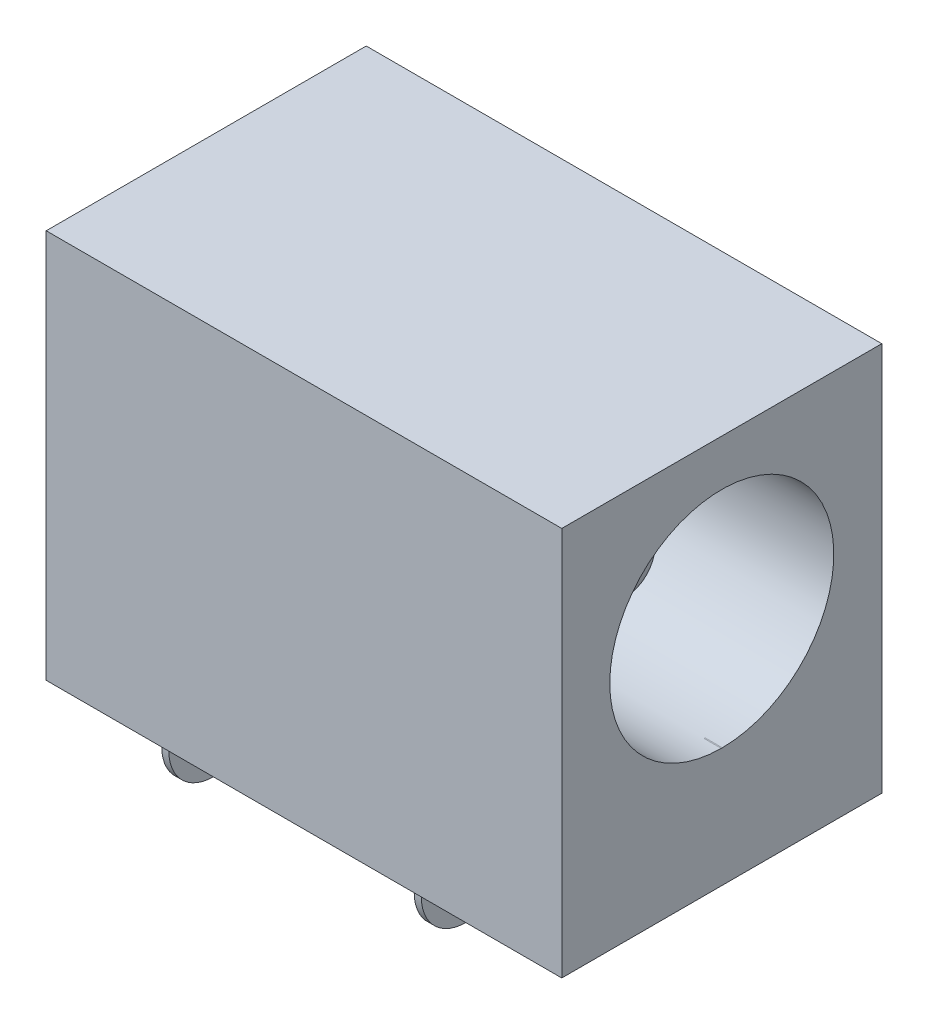
ISO-10303-21;
HEADER;
FILE_DESCRIPTION(('STEP AP214'),'2;1');
FILE_NAME('part.step','',(''),(''),'','','');
FILE_SCHEMA(('AUTOMOTIVE_DESIGN { 1 0 10303 214 1 1 1 1 }'));
ENDSEC;
DATA;
#1=APPLICATION_CONTEXT('core data for automotive mechanical design processes');
#2=APPLICATION_PROTOCOL_DEFINITION('international standard','automotive_design',2000,#1);
#3=PRODUCT_CONTEXT('',#1,'mechanical');
#4=PRODUCT('Part','Part','',(#3));
#5=PRODUCT_RELATED_PRODUCT_CATEGORY('part','',(#4));
#6=PRODUCT_DEFINITION_FORMATION('','',#4);
#7=PRODUCT_DEFINITION_CONTEXT('part definition',#1,'design');
#8=PRODUCT_DEFINITION('design','',#6,#7);
#9=PRODUCT_DEFINITION_SHAPE('','',#8);
#10=(LENGTH_UNIT() NAMED_UNIT(*) SI_UNIT(.MILLI.,.METRE.));
#11=(NAMED_UNIT(*) PLANE_ANGLE_UNIT() SI_UNIT($,.RADIAN.));
#12=(NAMED_UNIT(*) SI_UNIT($,.STERADIAN.) SOLID_ANGLE_UNIT());
#13=UNCERTAINTY_MEASURE_WITH_UNIT(LENGTH_MEASURE(1.E-05),#10,'distance_accuracy_value','');
#14=(GEOMETRIC_REPRESENTATION_CONTEXT(3) GLOBAL_UNCERTAINTY_ASSIGNED_CONTEXT((#13)) GLOBAL_UNIT_ASSIGNED_CONTEXT((#10,
#11,#12)) REPRESENTATION_CONTEXT('',''));
#15=CARTESIAN_POINT('',(0.,0.,0.));
#16=DIRECTION('',(0.,0.,1.));
#17=DIRECTION('',(1.,0.,0.));
#18=AXIS2_PLACEMENT_3D('',#15,#16,#17);
#19=CARTESIAN_POINT('',(0.,0.,4.25));
#20=DIRECTION('',(0.,-1.,0.));
#21=DIRECTION('',(0.,0.,-1.));
#22=AXIS2_PLACEMENT_3D('',#19,#20,#21);
#23=PLANE('',#22);
#24=DIRECTION('',(0.,0.,1.));
#25=VECTOR('',#24,1.);
#26=CARTESIAN_POINT('',(7.25,0.,0.));
#27=LINE('',#26,#25);
#28=CARTESIAN_POINT('',(7.25,0.,-4.5));
#29=VERTEX_POINT('',#28);
#30=CARTESIAN_POINT('',(7.25,0.,4.5));
#31=VERTEX_POINT('',#30);
#32=EDGE_CURVE('P0_E187',#29,#31,#27,.T.);
#33=ORIENTED_EDGE('',*,*,#32,.T.);
#34=DIRECTION('',(1.,0.,0.));
#35=VECTOR('',#34,1.);
#36=CARTESIAN_POINT('',(-7.25,0.,4.5));
#37=LINE('',#36,#35);
#38=CARTESIAN_POINT('',(-7.25,0.,4.5));
#39=VERTEX_POINT('',#38);
#40=EDGE_CURVE('P0_E132',#39,#31,#37,.T.);
#41=ORIENTED_EDGE('',*,*,#40,.F.);
#42=DIRECTION('',(0.,0.,1.));
#43=VECTOR('',#42,1.);
#44=CARTESIAN_POINT('',(-7.25,0.,0.));
#45=LINE('',#44,#43);
#46=CARTESIAN_POINT('',(-7.25,0.,-4.5));
#47=VERTEX_POINT('',#46);
#48=EDGE_CURVE('P0_E157',#47,#39,#45,.T.);
#49=ORIENTED_EDGE('',*,*,#48,.F.);
#50=DIRECTION('',(-1.,0.,0.));
#51=VECTOR('',#50,1.);
#52=CARTESIAN_POINT('',(-7.25,0.,-4.5));
#53=LINE('',#52,#51);
#54=EDGE_CURVE('P0_E193',#29,#47,#53,.T.);
#55=ORIENTED_EDGE('',*,*,#54,.F.);
#56=EDGE_LOOP('',(#33,#41,#49,#55));
#57=FACE_BOUND('',#56,.T.);
#58=ADVANCED_FACE('P0_F17',(#57),#23,.T.);
#59=CARTESIAN_POINT('',(0.,6.499962091467,0.));
#60=DIRECTION('',(1.,0.,0.));
#61=DIRECTION('',(0.,0.,-1.));
#62=AXIS2_PLACEMENT_3D('',#59,#60,#61);
#63=CYLINDRICAL_SURFACE('',#62,3.15);
#64=DIRECTION('',(1.,0.,0.));
#65=VECTOR('',#64,1.);
#66=CARTESIAN_POINT('',(0.,3.35,-0.01545387722779));
#67=LINE('',#66,#65);
#68=CARTESIAN_POINT('',(6.77,3.35,-0.01545387722618));
#69=VERTEX_POINT('',#68);
#70=CARTESIAN_POINT('',(7.25,3.35,-0.01545387722609));
#71=VERTEX_POINT('',#70);
#72=EDGE_CURVE('P0_E133',#69,#71,#67,.T.);
#73=ORIENTED_EDGE('',*,*,#72,.T.);
#74=CARTESIAN_POINT('',(7.25,6.499962091467,0.));
#75=DIRECTION('',(1.,0.,0.));
#76=DIRECTION('',(0.,0.,-1.));
#77=AXIS2_PLACEMENT_3D('',#74,#75,#76);
#78=CIRCLE('',#77,3.15);
#79=CARTESIAN_POINT('',(7.25,6.499962091467,3.15));
#80=VERTEX_POINT('',#79);
#81=EDGE_CURVE('P0_E146',#71,#80,#78,.T.);
#82=ORIENTED_EDGE('',*,*,#81,.T.);
#83=DIRECTION('',(-1.,0.,0.));
#84=VECTOR('',#83,1.);
#85=CARTESIAN_POINT('',(0.,6.499962091467,3.15));
#86=LINE('',#85,#84);
#87=CARTESIAN_POINT('',(-7.25,6.499962091467,3.15));
#88=VERTEX_POINT('',#87);
#89=EDGE_CURVE('P0_E11',#80,#88,#86,.T.);
#90=ORIENTED_EDGE('',*,*,#89,.T.);
#91=CARTESIAN_POINT('',(-7.25,6.499962091467,0.));
#92=DIRECTION('',(-1.,0.,0.));
#93=DIRECTION('',(0.,0.,-1.));
#94=AXIS2_PLACEMENT_3D('',#91,#92,#93);
#95=CIRCLE('',#94,3.15);
#96=CARTESIAN_POINT('',(-7.25,7.49999999999,2.987042715047));
#97=VERTEX_POINT('',#96);
#98=EDGE_CURVE('P0_E188',#88,#97,#95,.T.);
#99=ORIENTED_EDGE('',*,*,#98,.T.);
#100=DIRECTION('',(1.,0.,0.));
#101=VECTOR('',#100,1.);
#102=CARTESIAN_POINT('',(0.,7.499999999993,2.987042715046));
#103=LINE('',#102,#101);
#104=CARTESIAN_POINT('',(-3.55,7.5,2.987042715044));
#105=VERTEX_POINT('',#104);
#106=EDGE_CURVE('P0_E171',#97,#105,#103,.T.);
#107=ORIENTED_EDGE('',*,*,#106,.T.);
#108=CARTESIAN_POINT('',(-3.55,6.499962091467,0.));
#109=DIRECTION('',(-1.,0.,0.));
#110=DIRECTION('',(0.,0.,-1.));
#111=AXIS2_PLACEMENT_3D('',#108,#109,#110);
#112=CIRCLE('',#111,3.15);
#113=CARTESIAN_POINT('',(-3.55,7.5,-2.987042715044));
#114=VERTEX_POINT('',#113);
#115=EDGE_CURVE('P0_E162',#105,#114,#112,.T.);
#116=ORIENTED_EDGE('',*,*,#115,.T.);
#117=DIRECTION('',(-1.,0.,0.));
#118=VECTOR('',#117,1.);
#119=CARTESIAN_POINT('',(0.,7.499999999993,-2.987042715046));
#120=LINE('',#119,#118);
#121=CARTESIAN_POINT('',(-7.25,7.49999999999,-2.987042715047));
#122=VERTEX_POINT('',#121);
#123=EDGE_CURVE('P0_E167',#114,#122,#120,.T.);
#124=ORIENTED_EDGE('',*,*,#123,.T.);
#125=CARTESIAN_POINT('',(-7.25,6.499962091467,0.));
#126=DIRECTION('',(-1.,0.,0.));
#127=DIRECTION('',(0.,0.,-1.));
#128=AXIS2_PLACEMENT_3D('',#125,#126,#127);
#129=CIRCLE('',#128,3.15);
#130=CARTESIAN_POINT('',(-7.25,5.5,-2.987068096919));
#131=VERTEX_POINT('',#130);
#132=EDGE_CURVE('P0_E21',#122,#131,#129,.T.);
#133=ORIENTED_EDGE('',*,*,#132,.T.);
#134=DIRECTION('',(1.,0.,0.));
#135=VECTOR('',#134,1.);
#136=CARTESIAN_POINT('',(0.,5.500000000006,-2.987068096921));
#137=LINE('',#136,#135);
#138=CARTESIAN_POINT('',(-5.4,5.5,-2.987068096919));
#139=VERTEX_POINT('',#138);
#140=EDGE_CURVE('P0_E159',#131,#139,#137,.T.);
#141=ORIENTED_EDGE('',*,*,#140,.T.);
#142=CARTESIAN_POINT('',(-5.4,6.499962091467,0.));
#143=DIRECTION('',(-1.,0.,0.));
#144=DIRECTION('',(0.,0.,-1.));
#145=AXIS2_PLACEMENT_3D('',#142,#143,#144);
#146=CIRCLE('',#145,3.15);
#147=CARTESIAN_POINT('',(-5.4,5.5,2.987068096919));
#148=VERTEX_POINT('',#147);
#149=EDGE_CURVE('P0_E206',#139,#148,#146,.T.);
#150=ORIENTED_EDGE('',*,*,#149,.T.);
#151=DIRECTION('',(-1.,0.,0.));
#152=VECTOR('',#151,1.);
#153=CARTESIAN_POINT('',(0.,5.500000000006,2.987068096921));
#154=LINE('',#153,#152);
#155=CARTESIAN_POINT('',(-7.25,5.5,2.987068096919));
#156=VERTEX_POINT('',#155);
#157=EDGE_CURVE('P0_E42',#148,#156,#154,.T.);
#158=ORIENTED_EDGE('',*,*,#157,.T.);
#159=CARTESIAN_POINT('',(-7.25,6.499962091467,0.));
#160=DIRECTION('',(-1.,0.,0.));
#161=DIRECTION('',(0.,0.,-1.));
#162=AXIS2_PLACEMENT_3D('',#159,#160,#161);
#163=CIRCLE('',#162,3.15);
#164=EDGE_CURVE('P0_E177',#156,#88,#163,.T.);
#165=ORIENTED_EDGE('',*,*,#164,.T.);
#166=ORIENTED_EDGE('',*,*,#89,.F.);
#167=CARTESIAN_POINT('',(7.25,6.499962091467,0.));
#168=DIRECTION('',(1.,0.,0.));
#169=DIRECTION('',(0.,0.,-1.));
#170=AXIS2_PLACEMENT_3D('',#167,#168,#169);
#171=CIRCLE('',#170,3.15);
#172=CARTESIAN_POINT('',(7.25,3.35,0.01545387722609));
#173=VERTEX_POINT('',#172);
#174=EDGE_CURVE('P0_E136',#80,#173,#171,.T.);
#175=ORIENTED_EDGE('',*,*,#174,.T.);
#176=DIRECTION('',(-1.,0.,0.));
#177=VECTOR('',#176,1.);
#178=CARTESIAN_POINT('',(0.,3.35,0.01545387722779));
#179=LINE('',#178,#177);
#180=CARTESIAN_POINT('',(6.77,3.35,0.01545387722618));
#181=VERTEX_POINT('',#180);
#182=EDGE_CURVE('P0_E120',#173,#181,#179,.T.);
#183=ORIENTED_EDGE('',*,*,#182,.T.);
#184=CARTESIAN_POINT('',(6.77,6.499962091467,0.));
#185=DIRECTION('',(1.,0.,0.));
#186=DIRECTION('',(0.,0.,-1.));
#187=AXIS2_PLACEMENT_3D('',#184,#185,#186);
#188=CIRCLE('',#187,3.15);
#189=EDGE_CURVE('P0_E142',#181,#69,#188,.T.);
#190=ORIENTED_EDGE('',*,*,#189,.T.);
#191=EDGE_LOOP('',(#73,#82,#90,#99,#107,#116,#124,#133,#141,#150,#158,#165,#166,#175,#183,#190));
#192=FACE_BOUND('',#191,.T.);
#193=ADVANCED_FACE('P0_F137',(#192),#63,.F.);
#194=CARTESIAN_POINT('',(0.,10.95,-4.25));
#195=DIRECTION('',(0.,1.,0.));
#196=DIRECTION('',(1.,0.,0.));
#197=AXIS2_PLACEMENT_3D('',#194,#195,#196);
#198=PLANE('',#197);
#199=DIRECTION('',(0.,0.,1.));
#200=VECTOR('',#199,1.);
#201=CARTESIAN_POINT('',(7.25,10.95,0.));
#202=LINE('',#201,#200);
#203=CARTESIAN_POINT('',(7.25,10.95,-4.5));
#204=VERTEX_POINT('',#203);
#205=CARTESIAN_POINT('',(7.25,10.95,4.5));
#206=VERTEX_POINT('',#205);
#207=EDGE_CURVE('P0_E153',#204,#206,#202,.T.);
#208=ORIENTED_EDGE('',*,*,#207,.F.);
#209=DIRECTION('',(1.,0.,0.));
#210=VECTOR('',#209,1.);
#211=CARTESIAN_POINT('',(7.25,10.95,-4.5));
#212=LINE('',#211,#210);
#213=CARTESIAN_POINT('',(-7.25,10.95,-4.5));
#214=VERTEX_POINT('',#213);
#215=EDGE_CURVE('P0_E194',#214,#204,#212,.T.);
#216=ORIENTED_EDGE('',*,*,#215,.F.);
#217=DIRECTION('',(0.,0.,1.));
#218=VECTOR('',#217,1.);
#219=CARTESIAN_POINT('',(-7.25,10.95,2.125));
#220=LINE('',#219,#218);
#221=CARTESIAN_POINT('',(-7.25,10.95,4.5));
#222=VERTEX_POINT('',#221);
#223=EDGE_CURVE('P0_E176',#214,#222,#220,.T.);
#224=ORIENTED_EDGE('',*,*,#223,.T.);
#225=DIRECTION('',(-1.,0.,0.));
#226=VECTOR('',#225,1.);
#227=CARTESIAN_POINT('',(7.25,10.95,4.5));
#228=LINE('',#227,#226);
#229=EDGE_CURVE('P0_E28',#206,#222,#228,.T.);
#230=ORIENTED_EDGE('',*,*,#229,.F.);
#231=EDGE_LOOP('',(#208,#216,#224,#230));
#232=FACE_BOUND('',#231,.T.);
#233=ADVANCED_FACE('P0_F265',(#232),#198,.T.);
#234=CARTESIAN_POINT('',(0.,10.7,4.5));
#235=DIRECTION('',(0.,0.,1.));
#236=DIRECTION('',(1.,0.,0.));
#237=AXIS2_PLACEMENT_3D('',#234,#235,#236);
#238=PLANE('',#237);
#239=DIRECTION('',(0.,-1.,0.));
#240=VECTOR('',#239,1.);
#241=CARTESIAN_POINT('',(-7.25,10.95,4.5));
#242=LINE('',#241,#240);
#243=EDGE_CURVE('P0_E172',#222,#39,#242,.T.);
#244=ORIENTED_EDGE('',*,*,#243,.T.);
#245=ORIENTED_EDGE('',*,*,#40,.T.);
#246=DIRECTION('',(0.,1.,0.));
#247=VECTOR('',#246,1.);
#248=CARTESIAN_POINT('',(7.25,0.,4.5));
#249=LINE('',#248,#247);
#250=EDGE_CURVE('P0_E183',#31,#206,#249,.T.);
#251=ORIENTED_EDGE('',*,*,#250,.T.);
#252=ORIENTED_EDGE('',*,*,#229,.T.);
#253=EDGE_LOOP('',(#244,#245,#251,#252));
#254=FACE_BOUND('',#253,.T.);
#255=ADVANCED_FACE('P0_F259',(#254),#238,.T.);
#256=CARTESIAN_POINT('',(7.25,3.35,0.));
#257=DIRECTION('',(0.,1.,0.));
#258=DIRECTION('',(1.,0.,0.));
#259=AXIS2_PLACEMENT_3D('',#256,#257,#258);
#260=PLANE('',#259);
#261=ORIENTED_EDGE('',*,*,#72,.F.);
#262=DIRECTION('',(0.,0.,1.));
#263=VECTOR('',#262,1.);
#264=CARTESIAN_POINT('',(6.77,3.35,0.));
#265=LINE('',#264,#263);
#266=EDGE_CURVE('P0_E127',#69,#181,#265,.T.);
#267=ORIENTED_EDGE('',*,*,#266,.T.);
#268=ORIENTED_EDGE('',*,*,#182,.F.);
#269=DIRECTION('',(0.,0.,1.));
#270=VECTOR('',#269,1.);
#271=CARTESIAN_POINT('',(7.25,3.35,0.));
#272=LINE('',#271,#270);
#273=EDGE_CURVE('P0_E124',#71,#173,#272,.T.);
#274=ORIENTED_EDGE('',*,*,#273,.F.);
#275=EDGE_LOOP('',(#261,#267,#268,#274));
#276=FACE_BOUND('',#275,.T.);
#277=ADVANCED_FACE('P0_F122',(#276),#260,.T.);
#278=CARTESIAN_POINT('',(-5.4,5.500000000002,0.));
#279=DIRECTION('',(-8.92722079229E-13,1.,0.));
#280=DIRECTION('',(1.,8.92722079229E-13,0.));
#281=AXIS2_PLACEMENT_3D('',#278,#279,#280);
#282=PLANE('',#281);
#283=ORIENTED_EDGE('',*,*,#157,.F.);
#284=DIRECTION('',(0.,0.,1.));
#285=VECTOR('',#284,1.);
#286=CARTESIAN_POINT('',(-5.4,5.5,0.));
#287=LINE('',#286,#285);
#288=EDGE_CURVE('P0_E209',#139,#148,#287,.T.);
#289=ORIENTED_EDGE('',*,*,#288,.F.);
#290=ORIENTED_EDGE('',*,*,#140,.F.);
#291=DIRECTION('',(0.,0.,-1.));
#292=VECTOR('',#291,1.);
#293=CARTESIAN_POINT('',(-7.25,5.5,0.));
#294=LINE('',#293,#292);
#295=EDGE_CURVE('P0_E180',#156,#131,#294,.T.);
#296=ORIENTED_EDGE('',*,*,#295,.F.);
#297=EDGE_LOOP('',(#283,#289,#290,#296));
#298=FACE_BOUND('',#297,.T.);
#299=ADVANCED_FACE('P0_F339',(#298),#282,.T.);
#300=CARTESIAN_POINT('',(-5.4,1.3,0.));
#301=DIRECTION('',(1.,0.,0.));
#302=DIRECTION('',(0.,1.,0.));
#303=AXIS2_PLACEMENT_3D('',#300,#301,#302);
#304=PLANE('',#303);
#305=ORIENTED_EDGE('',*,*,#149,.F.);
#306=ORIENTED_EDGE('',*,*,#288,.T.);
#307=EDGE_LOOP('',(#305,#306));
#308=FACE_BOUND('',#307,.T.);
#309=ADVANCED_FACE('P0_F344',(#308),#304,.T.);
#310=CARTESIAN_POINT('',(6.77,3.35,0.));
#311=DIRECTION('',(-1.,0.,0.));
#312=DIRECTION('',(0.,0.,1.));
#313=AXIS2_PLACEMENT_3D('',#310,#311,#312);
#314=PLANE('',#313);
#315=ORIENTED_EDGE('',*,*,#189,.F.);
#316=ORIENTED_EDGE('',*,*,#266,.F.);
#317=EDGE_LOOP('',(#315,#316));
#318=FACE_BOUND('',#317,.T.);
#319=ADVANCED_FACE('P0_F362',(#318),#314,.T.);
#320=CARTESIAN_POINT('',(7.25,5.475,0.));
#321=DIRECTION('',(1.,0.,0.));
#322=DIRECTION('',(0.,1.,0.));
#323=AXIS2_PLACEMENT_3D('',#320,#321,#322);
#324=PLANE('',#323);
#325=ORIENTED_EDGE('',*,*,#81,.F.);
#326=ORIENTED_EDGE('',*,*,#273,.T.);
#327=ORIENTED_EDGE('',*,*,#174,.F.);
#328=EDGE_LOOP('',(#325,#326,#327));
#329=FACE_BOUND('',#328,.T.);
#330=ORIENTED_EDGE('',*,*,#250,.F.);
#331=ORIENTED_EDGE('',*,*,#32,.F.);
#332=DIRECTION('',(0.,-1.,0.));
#333=VECTOR('',#332,1.);
#334=CARTESIAN_POINT('',(7.25,2.8625,-4.5));
#335=LINE('',#334,#333);
#336=EDGE_CURVE('P0_E189',#204,#29,#335,.T.);
#337=ORIENTED_EDGE('',*,*,#336,.F.);
#338=ORIENTED_EDGE('',*,*,#207,.T.);
#339=EDGE_LOOP('',(#330,#331,#337,#338));
#340=FACE_BOUND('',#339,.T.);
#341=ADVANCED_FACE('P0_F144',(#329,#340),#324,.T.);
#342=CARTESIAN_POINT('',(-7.25,5.475,0.));
#343=DIRECTION('',(-1.,0.,0.));
#344=DIRECTION('',(0.,0.,1.));
#345=AXIS2_PLACEMENT_3D('',#342,#343,#344);
#346=PLANE('',#345);
#347=ORIENTED_EDGE('',*,*,#164,.F.);
#348=ORIENTED_EDGE('',*,*,#295,.T.);
#349=ORIENTED_EDGE('',*,*,#132,.F.);
#350=DIRECTION('',(0.,0.,1.));
#351=VECTOR('',#350,1.);
#352=CARTESIAN_POINT('',(-7.25,7.49999999999,0.));
#353=LINE('',#352,#351);
#354=EDGE_CURVE('P0_E237',#122,#97,#353,.T.);
#355=ORIENTED_EDGE('',*,*,#354,.T.);
#356=ORIENTED_EDGE('',*,*,#98,.F.);
#357=EDGE_LOOP('',(#347,#348,#349,#355,#356));
#358=FACE_BOUND('',#357,.T.);
#359=DIRECTION('',(0.,1.,0.));
#360=VECTOR('',#359,1.);
#361=CARTESIAN_POINT('',(-7.25,10.95,-4.5));
#362=LINE('',#361,#360);
#363=EDGE_CURVE('P0_E242',#47,#214,#362,.T.);
#364=ORIENTED_EDGE('',*,*,#363,.F.);
#365=ORIENTED_EDGE('',*,*,#48,.T.);
#366=ORIENTED_EDGE('',*,*,#243,.F.);
#367=ORIENTED_EDGE('',*,*,#223,.F.);
#368=EDGE_LOOP('',(#364,#365,#366,#367));
#369=FACE_BOUND('',#368,.T.);
#370=ADVANCED_FACE('P0_F271',(#358,#369),#346,.T.);
#371=CARTESIAN_POINT('',(0.,0.25,-4.5));
#372=DIRECTION('',(0.,0.,-1.));
#373=DIRECTION('',(0.,-1.,0.));
#374=AXIS2_PLACEMENT_3D('',#371,#372,#373);
#375=PLANE('',#374);
#376=ORIENTED_EDGE('',*,*,#363,.T.);
#377=ORIENTED_EDGE('',*,*,#215,.T.);
#378=ORIENTED_EDGE('',*,*,#336,.T.);
#379=ORIENTED_EDGE('',*,*,#54,.T.);
#380=EDGE_LOOP('',(#376,#377,#378,#379));
#381=FACE_BOUND('',#380,.T.);
#382=ADVANCED_FACE('P0_F375',(#381),#375,.T.);
#383=CARTESIAN_POINT('',(-7.25,7.49999999999,0.));
#384=DIRECTION('',(4.201612726152E-13,-1.,0.));
#385=DIRECTION('',(0.,0.,-1.));
#386=AXIS2_PLACEMENT_3D('',#383,#384,#385);
#387=PLANE('',#386);
#388=ORIENTED_EDGE('',*,*,#123,.F.);
#389=DIRECTION('',(0.,0.,-1.));
#390=VECTOR('',#389,1.);
#391=CARTESIAN_POINT('',(-3.55,7.5,0.));
#392=LINE('',#391,#390);
#393=EDGE_CURVE('P0_E166',#105,#114,#392,.T.);
#394=ORIENTED_EDGE('',*,*,#393,.F.);
#395=ORIENTED_EDGE('',*,*,#106,.F.);
#396=ORIENTED_EDGE('',*,*,#354,.F.);
#397=EDGE_LOOP('',(#388,#394,#395,#396));
#398=FACE_BOUND('',#397,.T.);
#399=ADVANCED_FACE('P0_F380',(#398),#387,.T.);
#400=CARTESIAN_POINT('',(-3.55,7.5,0.));
#401=DIRECTION('',(1.,0.,0.));
#402=DIRECTION('',(0.,1.,0.));
#403=AXIS2_PLACEMENT_3D('',#400,#401,#402);
#404=PLANE('',#403);
#405=ORIENTED_EDGE('',*,*,#115,.F.);
#406=ORIENTED_EDGE('',*,*,#393,.T.);
#407=EDGE_LOOP('',(#405,#406));
#408=FACE_BOUND('',#407,.T.);
#409=ADVANCED_FACE('P0_F19',(#408),#404,.T.);
#410=CLOSED_SHELL('',(#58,#193,#233,#255,#277,#299,#309,#319,#341,#370,#382,#399,#409));
#411=MANIFOLD_SOLID_BREP('P0_B1',#410);
#412=CARTESIAN_POINT('',(4.750000000003,6.5,0.));
#413=CARTESIAN_POINT('',(4.750000000003,6.5,0.));
#414=CARTESIAN_POINT('',(4.750000000003,6.5,0.));
#415=CARTESIAN_POINT('',(4.750000000003,6.5,0.));
#416=CARTESIAN_POINT('',(4.750000000003,6.5,0.));
#417=CARTESIAN_POINT('',(4.750000000003,6.5,0.));
#418=CARTESIAN_POINT('',(4.750000000003,6.5,0.));
#419=CARTESIAN_POINT('',(4.750000000003,6.5,0.));
#420=CARTESIAN_POINT('',(4.750000000003,6.5,0.));
#421=CARTESIAN_POINT('',(4.756929355711,6.921131351955,0.));
#422=CARTESIAN_POINT('',(4.756929355711,6.921131351955,0.421131351955));
#423=CARTESIAN_POINT('',(4.756929355711,6.5,0.421131351955));
#424=CARTESIAN_POINT('',(4.756929355711,6.078868648045,0.421131351955));
#425=CARTESIAN_POINT('',(4.756929355711,6.07886864804501,0.));
#426=CARTESIAN_POINT('',(4.756929355711,6.078868648045,-0.421131351955));
#427=CARTESIAN_POINT('',(4.756929355711,6.5,-0.421131351955));
#428=CARTESIAN_POINT('',(4.756929355711,6.921131351955,-0.421131351955));
#429=CARTESIAN_POINT('',(4.756929355711,6.921131351955,0.));
#430=CARTESIAN_POINT('',(4.611214431716,7.215442116666,0.));
#431=CARTESIAN_POINT('',(4.611214431716,7.215442116666,0.715442116666));
#432=CARTESIAN_POINT('',(4.611214431716,6.5,0.715442116666));
#433=CARTESIAN_POINT('',(4.611214431716,5.784557883334,0.715442116666));
#434=CARTESIAN_POINT('',(4.611214431716,5.784557883334,0.));
#435=CARTESIAN_POINT('',(4.611214431716,5.784557883334,-0.715442116666));
#436=CARTESIAN_POINT('',(4.611214431716,6.5,-0.715442116666));
#437=CARTESIAN_POINT('',(4.611214431716,7.215442116666,-0.715442116666));
#438=CARTESIAN_POINT('',(4.611214431716,7.215442116666,0.));
#439=CARTESIAN_POINT('',(4.465499507721,7.509752881377,0.));
#440=CARTESIAN_POINT('',(4.465499507721,7.50975288137699,1.009752881377));
#441=CARTESIAN_POINT('',(4.465499507721,6.5,1.009752881377));
#442=CARTESIAN_POINT('',(4.465499507721,5.490247118623,1.009752881377));
#443=CARTESIAN_POINT('',(4.465499507721,5.49024711862301,0.));
#444=CARTESIAN_POINT('',(4.465499507721,5.490247118623,-1.009752881377));
#445=CARTESIAN_POINT('',(4.465499507721,6.5,-1.009752881377));
#446=CARTESIAN_POINT('',(4.465499507721,7.50975288137699,-1.009752881377));
#447=CARTESIAN_POINT('',(4.465499507721,7.509752881377,0.));
#448=CARTESIAN_POINT('',(4.254894344808,7.499999999986,0.));
#449=CARTESIAN_POINT('',(4.254894344808,7.499999999986,0.999999999985999));
#450=CARTESIAN_POINT('',(4.254894344808,6.5,0.999999999986));
#451=CARTESIAN_POINT('',(4.254894344808,5.500000000014,0.999999999985999));
#452=CARTESIAN_POINT('',(4.254894344808,5.500000000014,0.));
#453=CARTESIAN_POINT('',(4.254894344808,5.500000000014,-0.999999999985999));
#454=CARTESIAN_POINT('',(4.254894344808,6.5,-0.999999999986));
#455=CARTESIAN_POINT('',(4.254894344808,7.499999999986,-0.999999999985999));
#456=CARTESIAN_POINT('',(4.254894344808,7.499999999986,0.));
#457=(BOUNDED_SURFACE() B_SPLINE_SURFACE(2,2,((#412,#413,#414,#415,#416,#417,#418,#419,#420),
(#421,#422,#423,#424,#425,#426,#427,#428,#429),(#430,#431,#432,#433,#434,#435,#436,#437,#438),
(#439,#440,#441,#442,#443,#444,#445,#446,#447),(#448,#449,#450,#451,#452,#453,#454,#455,#456)),
.UNSPECIFIED.,.F.,.T.,.F.) B_SPLINE_SURFACE_WITH_KNOTS((3,2,3),(3,2,2,2,3),(1.581804927077,
2.37876455907,3.175724191063),(0.,1.570796326795,3.14159265359,4.712388980385,6.28318530718),
.UNSPECIFIED.) GEOMETRIC_REPRESENTATION_ITEM() RATIONAL_B_SPLINE_SURFACE(((1.,0.707106781187,1.,
0.707106781187,1.,0.707106781187,1.,0.707106781187,1.),(0.921651917042,0.651706320434,
0.921651917042,0.651706320434,0.921651917042,0.651706320434,0.921651917042,0.651706320434,
0.921651917042),(1.,0.707106781187,1.,0.707106781187,1.,0.707106781187,1.,0.707106781187,1.),
(0.921651917042,0.651706320434,0.921651917042,0.651706320434,0.921651917042,0.651706320434,
0.921651917042,0.651706320434,0.921651917042),(1.,0.707106781187,1.,0.707106781187,1.,
0.707106781187,1.,0.707106781187,1.))) REPRESENTATION_ITEM('') SURFACE());
#458=CARTESIAN_POINT('',(4.250000001437,6.499962091467,0.));
#459=DIRECTION('',(0.,0.,1.));
#460=DIRECTION('',(-0.021951681030958,-0.999759032817366,0.));
#461=AXIS2_PLACEMENT_3D('',#458,#459,#460);
#462=ELLIPSE('',#461,1.000487079333,0.499908974318);
#463=CARTESIAN_POINT('',(4.750000000003,6.5,0.));
#464=VERTEX_POINT('',#463);
#465=CARTESIAN_POINT('',(4.254894344808,7.499999999986,0.));
#466=VERTEX_POINT('',#465);
#467=EDGE_CURVE('P1_E11',#464,#466,#462,.T.);
#468=CARTESIAN_POINT('',(4.254894344808,6.5,0.));
#469=DIRECTION('',(1.,0.,0.));
#470=DIRECTION('',(0.,0.,-1.));
#471=AXIS2_PLACEMENT_3D('',#468,#469,#470);
#472=CIRCLE('',#471,0.999999999986);
#473=CARTESIAN_POINT('',(4.254894344808,5.500000000008,0.));
#474=VERTEX_POINT('',#473);
#475=EDGE_CURVE('P1_E67',#466,#474,#472,.T.);
#476=CARTESIAN_POINT('',(4.254894344808,6.5,0.));
#477=DIRECTION('',(1.,0.,0.));
#478=DIRECTION('',(0.,0.,-1.));
#479=AXIS2_PLACEMENT_3D('',#476,#477,#478);
#480=CIRCLE('',#479,0.999999999986);
#481=EDGE_CURVE('P1_E59',#474,#466,#480,.T.);
#482=ORIENTED_EDGE('',*,*,#467,.T.);
#483=ORIENTED_EDGE('',*,*,#475,.T.);
#484=ORIENTED_EDGE('',*,*,#481,.T.);
#485=ORIENTED_EDGE('',*,*,#467,.F.);
#486=EDGE_LOOP('',(#482,#483,#484,#485));
#487=FACE_BOUND('',#486,.T.);
#488=ADVANCED_FACE('P1_F17',(#487),#457,.T.);
#489=CARTESIAN_POINT('',(-1.497552827596,6.5,0.));
#490=DIRECTION('',(1.,0.,0.));
#491=DIRECTION('',(0.,1.,0.));
#492=AXIS2_PLACEMENT_3D('',#489,#490,#491);
#493=CYLINDRICAL_SURFACE('',#492,0.999999999992);
#494=ORIENTED_EDGE('',*,*,#475,.F.);
#495=ORIENTED_EDGE('',*,*,#481,.F.);
#496=DIRECTION('',(-1.,0.,0.));
#497=VECTOR('',#496,1.);
#498=CARTESIAN_POINT('',(-1.497552827596,5.500000000008,0.));
#499=LINE('',#498,#497);
#500=CARTESIAN_POINT('',(-7.25,5.500000000008,0.));
#501=VERTEX_POINT('',#500);
#502=EDGE_CURVE('P1_E26',#474,#501,#499,.T.);
#503=ORIENTED_EDGE('',*,*,#502,.T.);
#504=CARTESIAN_POINT('',(-7.25,6.5,0.));
#505=DIRECTION('',(1.,0.,0.));
#506=DIRECTION('',(0.,0.,-1.));
#507=AXIS2_PLACEMENT_3D('',#504,#505,#506);
#508=CIRCLE('',#507,0.99999999999);
#509=CARTESIAN_POINT('',(-7.25,7.49999999999,0.));
#510=VERTEX_POINT('',#509);
#511=EDGE_CURVE('P1_E54',#501,#510,#508,.T.);
#512=ORIENTED_EDGE('',*,*,#511,.T.);
#513=CARTESIAN_POINT('',(-7.25,6.5,0.));
#514=DIRECTION('',(1.,0.,0.));
#515=DIRECTION('',(0.,0.,-1.));
#516=AXIS2_PLACEMENT_3D('',#513,#514,#515);
#517=CIRCLE('',#516,0.99999999999);
#518=EDGE_CURVE('P1_E65',#510,#501,#517,.T.);
#519=ORIENTED_EDGE('',*,*,#518,.T.);
#520=ORIENTED_EDGE('',*,*,#502,.F.);
#521=EDGE_LOOP('',(#494,#495,#503,#512,#519,#520));
#522=FACE_BOUND('',#521,.T.);
#523=ADVANCED_FACE('P1_F19',(#522),#493,.T.);
#524=CARTESIAN_POINT('',(-7.25,7.49999999999,0.));
#525=DIRECTION('',(-1.,0.,0.));
#526=DIRECTION('',(0.,0.,1.));
#527=AXIS2_PLACEMENT_3D('',#524,#525,#526);
#528=PLANE('',#527);
#529=ORIENTED_EDGE('',*,*,#518,.F.);
#530=ORIENTED_EDGE('',*,*,#511,.F.);
#531=EDGE_LOOP('',(#529,#530));
#532=FACE_BOUND('',#531,.T.);
#533=ADVANCED_FACE('P1_F64',(#532),#528,.T.);
#534=CLOSED_SHELL('',(#488,#523,#533));
#535=MANIFOLD_SOLID_BREP('P1_B1',#534);
#536=CARTESIAN_POINT('',(-0.15,-2.25,0.));
#537=DIRECTION('',(1.,0.,0.));
#538=DIRECTION('',(0.,1.,0.));
#539=AXIS2_PLACEMENT_3D('',#536,#537,#538);
#540=PLANE('',#539);
#541=CARTESIAN_POINT('',(-0.15,-3.25,0.));
#542=DIRECTION('',(1.,0.,0.));
#543=DIRECTION('',(0.,0.,-1.));
#544=AXIS2_PLACEMENT_3D('',#541,#542,#543);
#545=CIRCLE('',#544,0.625);
#546=CARTESIAN_POINT('',(-0.15,-3.25,0.625));
#547=VERTEX_POINT('',#546);
#548=EDGE_CURVE('P2_E21',#547,#547,#545,.T.);
#549=ORIENTED_EDGE('',*,*,#548,.T.);
#550=EDGE_LOOP('',(#549));
#551=FACE_BOUND('',#550,.T.);
#552=CARTESIAN_POINT('',(-0.15,-3.25,0.));
#553=DIRECTION('',(-1.,0.,0.));
#554=DIRECTION('',(0.,0.,1.));
#555=AXIS2_PLACEMENT_3D('',#552,#553,#554);
#556=CIRCLE('',#555,1.25);
#557=CARTESIAN_POINT('',(-0.15,-3.25,-1.25));
#558=VERTEX_POINT('',#557);
#559=CARTESIAN_POINT('',(-0.15,-3.25,1.25));
#560=VERTEX_POINT('',#559);
#561=EDGE_CURVE('P2_E113',#558,#560,#556,.T.);
#562=ORIENTED_EDGE('',*,*,#561,.T.);
#563=DIRECTION('',(0.,1.,0.));
#564=VECTOR('',#563,1.);
#565=CARTESIAN_POINT('',(-0.15,-2.75,1.25));
#566=LINE('',#565,#564);
#567=CARTESIAN_POINT('',(-0.15,0.,1.25));
#568=VERTEX_POINT('',#567);
#569=EDGE_CURVE('P2_E98',#560,#568,#566,.T.);
#570=ORIENTED_EDGE('',*,*,#569,.T.);
#571=DIRECTION('',(0.,0.,-1.));
#572=VECTOR('',#571,1.);
#573=CARTESIAN_POINT('',(-0.15,0.,0.625));
#574=LINE('',#573,#572);
#575=CARTESIAN_POINT('',(-0.15,0.,-1.25));
#576=VERTEX_POINT('',#575);
#577=EDGE_CURVE('P2_E28',#568,#576,#574,.T.);
#578=ORIENTED_EDGE('',*,*,#577,.T.);
#579=DIRECTION('',(0.,-1.,0.));
#580=VECTOR('',#579,1.);
#581=CARTESIAN_POINT('',(-0.15,-1.125,-1.25));
#582=LINE('',#581,#580);
#583=EDGE_CURVE('P2_E86',#576,#558,#582,.T.);
#584=ORIENTED_EDGE('',*,*,#583,.T.);
#585=EDGE_LOOP('',(#562,#570,#578,#584));
#586=FACE_BOUND('',#585,.T.);
#587=ADVANCED_FACE('P2_F17',(#551,#586),#540,.F.);
#588=CARTESIAN_POINT('',(0.05,-2.25,0.));
#589=DIRECTION('',(1.,0.,0.));
#590=DIRECTION('',(0.,1.,0.));
#591=AXIS2_PLACEMENT_3D('',#588,#589,#590);
#592=PLANE('',#591);
#593=CARTESIAN_POINT('',(0.05,-3.25,0.));
#594=DIRECTION('',(-1.,0.,0.));
#595=DIRECTION('',(0.,0.,-1.));
#596=AXIS2_PLACEMENT_3D('',#593,#594,#595);
#597=CIRCLE('',#596,0.625);
#598=CARTESIAN_POINT('',(0.05,-3.25,0.625));
#599=VERTEX_POINT('',#598);
#600=EDGE_CURVE('P2_E82',#599,#599,#597,.T.);
#601=ORIENTED_EDGE('',*,*,#600,.T.);
#602=EDGE_LOOP('',(#601));
#603=FACE_BOUND('',#602,.T.);
#604=DIRECTION('',(0.,1.,0.));
#605=VECTOR('',#604,1.);
#606=CARTESIAN_POINT('',(0.05,-3.25,1.25));
#607=LINE('',#606,#605);
#608=CARTESIAN_POINT('',(0.05,-3.25,1.25));
#609=VERTEX_POINT('',#608);
#610=CARTESIAN_POINT('',(0.05,0.,1.25));
#611=VERTEX_POINT('',#610);
#612=EDGE_CURVE('P2_E102',#609,#611,#607,.T.);
#613=ORIENTED_EDGE('',*,*,#612,.F.);
#614=CARTESIAN_POINT('',(0.05,-3.25,0.));
#615=DIRECTION('',(1.,0.,0.));
#616=DIRECTION('',(0.,0.,1.));
#617=AXIS2_PLACEMENT_3D('',#614,#615,#616);
#618=CIRCLE('',#617,1.25);
#619=CARTESIAN_POINT('',(0.05,-3.25,-1.25));
#620=VERTEX_POINT('',#619);
#621=EDGE_CURVE('P2_E108',#609,#620,#618,.T.);
#622=ORIENTED_EDGE('',*,*,#621,.T.);
#623=DIRECTION('',(0.,-1.,0.));
#624=VECTOR('',#623,1.);
#625=CARTESIAN_POINT('',(0.05,0.,-1.25));
#626=LINE('',#625,#624);
#627=CARTESIAN_POINT('',(0.05,0.,-1.25));
#628=VERTEX_POINT('',#627);
#629=EDGE_CURVE('P2_E101',#628,#620,#626,.T.);
#630=ORIENTED_EDGE('',*,*,#629,.F.);
#631=DIRECTION('',(0.,0.,-1.));
#632=VECTOR('',#631,1.);
#633=CARTESIAN_POINT('',(0.05,0.,1.25));
#634=LINE('',#633,#632);
#635=EDGE_CURVE('P2_E11',#611,#628,#634,.T.);
#636=ORIENTED_EDGE('',*,*,#635,.F.);
#637=EDGE_LOOP('',(#613,#622,#630,#636));
#638=FACE_BOUND('',#637,.T.);
#639=ADVANCED_FACE('P2_F83',(#603,#638),#592,.T.);
#640=CARTESIAN_POINT('',(0.05,0.,1.25));
#641=DIRECTION('',(0.,1.,0.));
#642=DIRECTION('',(1.,0.,0.));
#643=AXIS2_PLACEMENT_3D('',#640,#641,#642);
#644=PLANE('',#643);
#645=ORIENTED_EDGE('',*,*,#577,.F.);
#646=DIRECTION('',(-1.,0.,0.));
#647=VECTOR('',#646,1.);
#648=CARTESIAN_POINT('',(0.05,0.,1.25));
#649=LINE('',#648,#647);
#650=EDGE_CURVE('P2_E106',#611,#568,#649,.T.);
#651=ORIENTED_EDGE('',*,*,#650,.F.);
#652=ORIENTED_EDGE('',*,*,#635,.T.);
#653=DIRECTION('',(-1.,0.,0.));
#654=VECTOR('',#653,1.);
#655=CARTESIAN_POINT('',(0.05,0.,-1.25));
#656=LINE('',#655,#654);
#657=EDGE_CURVE('P2_E93',#628,#576,#656,.T.);
#658=ORIENTED_EDGE('',*,*,#657,.T.);
#659=EDGE_LOOP('',(#645,#651,#652,#658));
#660=FACE_BOUND('',#659,.T.);
#661=ADVANCED_FACE('P2_F184',(#660),#644,.T.);
#662=CARTESIAN_POINT('',(0.05,0.,-1.25));
#663=DIRECTION('',(0.,0.,-1.));
#664=DIRECTION('',(0.,-1.,0.));
#665=AXIS2_PLACEMENT_3D('',#662,#663,#664);
#666=PLANE('',#665);
#667=ORIENTED_EDGE('',*,*,#583,.F.);
#668=ORIENTED_EDGE('',*,*,#657,.F.);
#669=ORIENTED_EDGE('',*,*,#629,.T.);
#670=DIRECTION('',(-1.,0.,0.));
#671=VECTOR('',#670,1.);
#672=CARTESIAN_POINT('',(0.05,-3.25,-1.25));
#673=LINE('',#672,#671);
#674=EDGE_CURVE('P2_E112',#620,#558,#673,.T.);
#675=ORIENTED_EDGE('',*,*,#674,.T.);
#676=EDGE_LOOP('',(#667,#668,#669,#675));
#677=FACE_BOUND('',#676,.T.);
#678=ADVANCED_FACE('P2_F19',(#677),#666,.T.);
#679=CARTESIAN_POINT('',(0.05,-3.25,0.));
#680=DIRECTION('',(-1.,0.,0.));
#681=DIRECTION('',(0.,0.,-1.));
#682=AXIS2_PLACEMENT_3D('',#679,#680,#681);
#683=CYLINDRICAL_SURFACE('',#682,0.625);
#684=ORIENTED_EDGE('',*,*,#548,.F.);
#685=DIRECTION('',(1.,0.,0.));
#686=VECTOR('',#685,1.);
#687=CARTESIAN_POINT('',(0.05,-3.25,0.625));
#688=LINE('',#687,#686);
#689=EDGE_CURVE('P2_E76',#547,#599,#688,.T.);
#690=ORIENTED_EDGE('',*,*,#689,.T.);
#691=ORIENTED_EDGE('',*,*,#600,.F.);
#692=ORIENTED_EDGE('',*,*,#689,.F.);
#693=EDGE_LOOP('',(#684,#690,#691,#692));
#694=FACE_BOUND('',#693,.T.);
#695=ADVANCED_FACE('P2_F208',(#694),#683,.F.);
#696=CARTESIAN_POINT('',(0.05,-3.25,0.));
#697=DIRECTION('',(-1.,0.,0.));
#698=DIRECTION('',(0.,0.,1.));
#699=AXIS2_PLACEMENT_3D('',#696,#697,#698);
#700=CYLINDRICAL_SURFACE('',#699,1.25);
#701=ORIENTED_EDGE('',*,*,#561,.F.);
#702=ORIENTED_EDGE('',*,*,#674,.F.);
#703=ORIENTED_EDGE('',*,*,#621,.F.);
#704=DIRECTION('',(-1.,0.,0.));
#705=VECTOR('',#704,1.);
#706=CARTESIAN_POINT('',(0.05,-3.25,1.25));
#707=LINE('',#706,#705);
#708=EDGE_CURVE('P2_E107',#609,#560,#707,.T.);
#709=ORIENTED_EDGE('',*,*,#708,.T.);
#710=EDGE_LOOP('',(#701,#702,#703,#709));
#711=FACE_BOUND('',#710,.T.);
#712=ADVANCED_FACE('P2_F193',(#711),#700,.T.);
#713=CARTESIAN_POINT('',(0.05,-3.25,1.25));
#714=DIRECTION('',(0.,0.,1.));
#715=DIRECTION('',(1.,0.,0.));
#716=AXIS2_PLACEMENT_3D('',#713,#714,#715);
#717=PLANE('',#716);
#718=ORIENTED_EDGE('',*,*,#569,.F.);
#719=ORIENTED_EDGE('',*,*,#708,.F.);
#720=ORIENTED_EDGE('',*,*,#612,.T.);
#721=ORIENTED_EDGE('',*,*,#650,.T.);
#722=EDGE_LOOP('',(#718,#719,#720,#721));
#723=FACE_BOUND('',#722,.T.);
#724=ADVANCED_FACE('P2_F132',(#723),#717,.T.);
#725=CLOSED_SHELL('',(#587,#639,#661,#678,#695,#712,#724));
#726=MANIFOLD_SOLID_BREP('P2_B1',#725);
#727=CARTESIAN_POINT('',(-7.25,-2.25,0.));
#728=DIRECTION('',(1.,0.,0.));
#729=DIRECTION('',(0.,1.,0.));
#730=AXIS2_PLACEMENT_3D('',#727,#728,#729);
#731=PLANE('',#730);
#732=CARTESIAN_POINT('',(-7.25,-3.25,0.));
#733=DIRECTION('',(1.,0.,0.));
#734=DIRECTION('',(0.,0.,-1.));
#735=AXIS2_PLACEMENT_3D('',#732,#733,#734);
#736=CIRCLE('',#735,0.625);
#737=CARTESIAN_POINT('',(-7.25,-3.25,0.625));
#738=VERTEX_POINT('',#737);
#739=EDGE_CURVE('P3_E89',#738,#738,#736,.T.);
#740=ORIENTED_EDGE('',*,*,#739,.T.);
#741=EDGE_LOOP('',(#740));
#742=FACE_BOUND('',#741,.T.);
#743=CARTESIAN_POINT('',(-7.25,-3.25,0.));
#744=DIRECTION('',(-1.,0.,0.));
#745=DIRECTION('',(0.,0.,1.));
#746=AXIS2_PLACEMENT_3D('',#743,#744,#745);
#747=CIRCLE('',#746,1.25);
#748=CARTESIAN_POINT('',(-7.25,-3.25,-1.25));
#749=VERTEX_POINT('',#748);
#750=CARTESIAN_POINT('',(-7.25,-3.25,1.25));
#751=VERTEX_POINT('',#750);
#752=EDGE_CURVE('P3_E103',#749,#751,#747,.T.);
#753=ORIENTED_EDGE('',*,*,#752,.T.);
#754=DIRECTION('',(0.,1.,0.));
#755=VECTOR('',#754,1.);
#756=CARTESIAN_POINT('',(-7.25,-2.75,1.25));
#757=LINE('',#756,#755);
#758=CARTESIAN_POINT('',(-7.25,0.,1.25));
#759=VERTEX_POINT('',#758);
#760=EDGE_CURVE('P3_E21',#751,#759,#757,.T.);
#761=ORIENTED_EDGE('',*,*,#760,.T.);
#762=DIRECTION('',(0.,0.,-1.));
#763=VECTOR('',#762,1.);
#764=CARTESIAN_POINT('',(-7.25,0.,0.625));
#765=LINE('',#764,#763);
#766=CARTESIAN_POINT('',(-7.25,0.,-1.25));
#767=VERTEX_POINT('',#766);
#768=EDGE_CURVE('P3_E28',#759,#767,#765,.T.);
#769=ORIENTED_EDGE('',*,*,#768,.T.);
#770=DIRECTION('',(0.,-1.,0.));
#771=VECTOR('',#770,1.);
#772=CARTESIAN_POINT('',(-7.25,-1.125,-1.25));
#773=LINE('',#772,#771);
#774=EDGE_CURVE('P3_E80',#767,#749,#773,.T.);
#775=ORIENTED_EDGE('',*,*,#774,.T.);
#776=EDGE_LOOP('',(#753,#761,#769,#775));
#777=FACE_BOUND('',#776,.T.);
#778=ADVANCED_FACE('P3_F17',(#742,#777),#731,.F.);
#779=CARTESIAN_POINT('',(-7.05,-2.25,0.));
#780=DIRECTION('',(1.,0.,0.));
#781=DIRECTION('',(0.,1.,0.));
#782=AXIS2_PLACEMENT_3D('',#779,#780,#781);
#783=PLANE('',#782);
#784=CARTESIAN_POINT('',(-7.05,-3.25,0.));
#785=DIRECTION('',(-1.,0.,0.));
#786=DIRECTION('',(0.,0.,-1.));
#787=AXIS2_PLACEMENT_3D('',#784,#785,#786);
#788=CIRCLE('',#787,0.625);
#789=CARTESIAN_POINT('',(-7.05,-3.25,0.625));
#790=VERTEX_POINT('',#789);
#791=EDGE_CURVE('P3_E74',#790,#790,#788,.T.);
#792=ORIENTED_EDGE('',*,*,#791,.T.);
#793=EDGE_LOOP('',(#792));
#794=FACE_BOUND('',#793,.T.);
#795=DIRECTION('',(0.,1.,0.));
#796=VECTOR('',#795,1.);
#797=CARTESIAN_POINT('',(-7.05,-3.25,1.25));
#798=LINE('',#797,#796);
#799=CARTESIAN_POINT('',(-7.05,-3.25,1.25));
#800=VERTEX_POINT('',#799);
#801=CARTESIAN_POINT('',(-7.05,0.,1.25));
#802=VERTEX_POINT('',#801);
#803=EDGE_CURVE('P3_E108',#800,#802,#798,.T.);
#804=ORIENTED_EDGE('',*,*,#803,.F.);
#805=CARTESIAN_POINT('',(-7.05,-3.25,0.));
#806=DIRECTION('',(1.,0.,0.));
#807=DIRECTION('',(0.,0.,1.));
#808=AXIS2_PLACEMENT_3D('',#805,#806,#807);
#809=CIRCLE('',#808,1.25);
#810=CARTESIAN_POINT('',(-7.05,-3.25,-1.25));
#811=VERTEX_POINT('',#810);
#812=EDGE_CURVE('P3_E102',#800,#811,#809,.T.);
#813=ORIENTED_EDGE('',*,*,#812,.T.);
#814=DIRECTION('',(0.,-1.,0.));
#815=VECTOR('',#814,1.);
#816=CARTESIAN_POINT('',(-7.05,0.,-1.25));
#817=LINE('',#816,#815);
#818=CARTESIAN_POINT('',(-7.05,0.,-1.25));
#819=VERTEX_POINT('',#818);
#820=EDGE_CURVE('P3_E93',#819,#811,#817,.T.);
#821=ORIENTED_EDGE('',*,*,#820,.F.);
#822=DIRECTION('',(0.,0.,-1.));
#823=VECTOR('',#822,1.);
#824=CARTESIAN_POINT('',(-7.05,0.,1.25));
#825=LINE('',#824,#823);
#826=EDGE_CURVE('P3_E11',#802,#819,#825,.T.);
#827=ORIENTED_EDGE('',*,*,#826,.F.);
#828=EDGE_LOOP('',(#804,#813,#821,#827));
#829=FACE_BOUND('',#828,.T.);
#830=ADVANCED_FACE('P3_F75',(#794,#829),#783,.T.);
#831=CARTESIAN_POINT('',(-7.05,0.,1.25));
#832=DIRECTION('',(0.,1.,0.));
#833=DIRECTION('',(1.,0.,0.));
#834=AXIS2_PLACEMENT_3D('',#831,#832,#833);
#835=PLANE('',#834);
#836=ORIENTED_EDGE('',*,*,#768,.F.);
#837=DIRECTION('',(-1.,0.,0.));
#838=VECTOR('',#837,1.);
#839=CARTESIAN_POINT('',(-7.05,0.,1.25));
#840=LINE('',#839,#838);
#841=EDGE_CURVE('P3_E117',#802,#759,#840,.T.);
#842=ORIENTED_EDGE('',*,*,#841,.F.);
#843=ORIENTED_EDGE('',*,*,#826,.T.);
#844=DIRECTION('',(-1.,0.,0.));
#845=VECTOR('',#844,1.);
#846=CARTESIAN_POINT('',(-7.05,0.,-1.25));
#847=LINE('',#846,#845);
#848=EDGE_CURVE('P3_E88',#819,#767,#847,.T.);
#849=ORIENTED_EDGE('',*,*,#848,.T.);
#850=EDGE_LOOP('',(#836,#842,#843,#849));
#851=FACE_BOUND('',#850,.T.);
#852=ADVANCED_FACE('P3_F140',(#851),#835,.T.);
#853=CARTESIAN_POINT('',(-7.05,0.,-1.25));
#854=DIRECTION('',(0.,0.,-1.));
#855=DIRECTION('',(0.,-1.,0.));
#856=AXIS2_PLACEMENT_3D('',#853,#854,#855);
#857=PLANE('',#856);
#858=ORIENTED_EDGE('',*,*,#774,.F.);
#859=ORIENTED_EDGE('',*,*,#848,.F.);
#860=ORIENTED_EDGE('',*,*,#820,.T.);
#861=DIRECTION('',(-1.,0.,0.));
#862=VECTOR('',#861,1.);
#863=CARTESIAN_POINT('',(-7.05,-3.25,-1.25));
#864=LINE('',#863,#862);
#865=EDGE_CURVE('P3_E98',#811,#749,#864,.T.);
#866=ORIENTED_EDGE('',*,*,#865,.T.);
#867=EDGE_LOOP('',(#858,#859,#860,#866));
#868=FACE_BOUND('',#867,.T.);
#869=ADVANCED_FACE('P3_F130',(#868),#857,.T.);
#870=CARTESIAN_POINT('',(-7.05,-3.25,0.));
#871=DIRECTION('',(-1.,0.,0.));
#872=DIRECTION('',(0.,0.,-1.));
#873=AXIS2_PLACEMENT_3D('',#870,#871,#872);
#874=CYLINDRICAL_SURFACE('',#873,0.625);
#875=ORIENTED_EDGE('',*,*,#739,.F.);
#876=DIRECTION('',(1.,0.,0.));
#877=VECTOR('',#876,1.);
#878=CARTESIAN_POINT('',(-7.05,-3.25,0.625));
#879=LINE('',#878,#877);
#880=EDGE_CURVE('P3_E81',#738,#790,#879,.T.);
#881=ORIENTED_EDGE('',*,*,#880,.T.);
#882=ORIENTED_EDGE('',*,*,#791,.F.);
#883=ORIENTED_EDGE('',*,*,#880,.F.);
#884=EDGE_LOOP('',(#875,#881,#882,#883));
#885=FACE_BOUND('',#884,.T.);
#886=ADVANCED_FACE('P3_F19',(#885),#874,.F.);
#887=CARTESIAN_POINT('',(-7.05,-3.25,0.));
#888=DIRECTION('',(-1.,0.,0.));
#889=DIRECTION('',(0.,0.,1.));
#890=AXIS2_PLACEMENT_3D('',#887,#888,#889);
#891=CYLINDRICAL_SURFACE('',#890,1.25);
#892=ORIENTED_EDGE('',*,*,#752,.F.);
#893=ORIENTED_EDGE('',*,*,#865,.F.);
#894=ORIENTED_EDGE('',*,*,#812,.F.);
#895=DIRECTION('',(-1.,0.,0.));
#896=VECTOR('',#895,1.);
#897=CARTESIAN_POINT('',(-7.05,-3.25,1.25));
#898=LINE('',#897,#896);
#899=EDGE_CURVE('P3_E104',#800,#751,#898,.T.);
#900=ORIENTED_EDGE('',*,*,#899,.T.);
#901=EDGE_LOOP('',(#892,#893,#894,#900));
#902=FACE_BOUND('',#901,.T.);
#903=ADVANCED_FACE('P3_F129',(#902),#891,.T.);
#904=CARTESIAN_POINT('',(-7.05,-3.25,1.25));
#905=DIRECTION('',(0.,0.,1.));
#906=DIRECTION('',(1.,0.,0.));
#907=AXIS2_PLACEMENT_3D('',#904,#905,#906);
#908=PLANE('',#907);
#909=ORIENTED_EDGE('',*,*,#760,.F.);
#910=ORIENTED_EDGE('',*,*,#899,.F.);
#911=ORIENTED_EDGE('',*,*,#803,.T.);
#912=ORIENTED_EDGE('',*,*,#841,.T.);
#913=EDGE_LOOP('',(#909,#910,#911,#912));
#914=FACE_BOUND('',#913,.T.);
#915=ADVANCED_FACE('P3_F137',(#914),#908,.T.);
#916=CLOSED_SHELL('',(#778,#830,#852,#869,#886,#903,#915));
#917=MANIFOLD_SOLID_BREP('P3_B1',#916);
#918=CARTESIAN_POINT('',(-3.25,-2.25,-4.8));
#919=DIRECTION('',(0.,0.,1.));
#920=DIRECTION('',(1.,0.,0.));
#921=AXIS2_PLACEMENT_3D('',#918,#919,#920);
#922=PLANE('',#921);
#923=CARTESIAN_POINT('',(-3.25,-3.25,-4.8));
#924=DIRECTION('',(0.,0.,1.));
#925=DIRECTION('',(1.,0.,0.));
#926=AXIS2_PLACEMENT_3D('',#923,#924,#925);
#927=CIRCLE('',#926,0.625);
#928=CARTESIAN_POINT('',(-3.875,-3.25,-4.8));
#929=VERTEX_POINT('',#928);
#930=EDGE_CURVE('P4_E81',#929,#929,#927,.T.);
#931=ORIENTED_EDGE('',*,*,#930,.T.);
#932=EDGE_LOOP('',(#931));
#933=FACE_BOUND('',#932,.T.);
#934=DIRECTION('',(0.,-1.,0.));
#935=VECTOR('',#934,1.);
#936=CARTESIAN_POINT('',(-2.,-1.125,-4.8));
#937=LINE('',#936,#935);
#938=CARTESIAN_POINT('',(-2.,0.,-4.8));
#939=VERTEX_POINT('',#938);
#940=CARTESIAN_POINT('',(-2.,-3.25,-4.8));
#941=VERTEX_POINT('',#940);
#942=EDGE_CURVE('P4_E20',#939,#941,#937,.T.);
#943=ORIENTED_EDGE('',*,*,#942,.T.);
#944=CARTESIAN_POINT('',(-3.25,-3.25,-4.8));
#945=DIRECTION('',(0.,0.,-1.));
#946=DIRECTION('',(-1.,0.,0.));
#947=AXIS2_PLACEMENT_3D('',#944,#945,#946);
#948=CIRCLE('',#947,1.25);
#949=CARTESIAN_POINT('',(-4.5,-3.25,-4.8));
#950=VERTEX_POINT('',#949);
#951=EDGE_CURVE('P4_E90',#941,#950,#948,.T.);
#952=ORIENTED_EDGE('',*,*,#951,.T.);
#953=DIRECTION('',(0.,1.,0.));
#954=VECTOR('',#953,1.);
#955=CARTESIAN_POINT('',(-4.5,-2.75,-4.8));
#956=LINE('',#955,#954);
#957=CARTESIAN_POINT('',(-4.5,0.,-4.8));
#958=VERTEX_POINT('',#957);
#959=EDGE_CURVE('P4_E27',#950,#958,#956,.T.);
#960=ORIENTED_EDGE('',*,*,#959,.T.);
#961=DIRECTION('',(1.,0.,0.));
#962=VECTOR('',#961,1.);
#963=CARTESIAN_POINT('',(-3.875,0.,-4.8));
#964=LINE('',#963,#962);
#965=EDGE_CURVE('P4_E70',#958,#939,#964,.T.);
#966=ORIENTED_EDGE('',*,*,#965,.T.);
#967=EDGE_LOOP('',(#943,#952,#960,#966));
#968=FACE_BOUND('',#967,.T.);
#969=ADVANCED_FACE('P4_F17',(#933,#968),#922,.F.);
#970=CARTESIAN_POINT('',(-3.25,-2.25,-4.5));
#971=DIRECTION('',(0.,0.,1.));
#972=DIRECTION('',(1.,0.,0.));
#973=AXIS2_PLACEMENT_3D('',#970,#971,#972);
#974=PLANE('',#973);
#975=CARTESIAN_POINT('',(-3.25,-3.25,-4.5));
#976=DIRECTION('',(0.,0.,-1.));
#977=DIRECTION('',(1.,0.,0.));
#978=AXIS2_PLACEMENT_3D('',#975,#976,#977);
#979=CIRCLE('',#978,0.625);
#980=CARTESIAN_POINT('',(-3.875,-3.25,-4.5));
#981=VERTEX_POINT('',#980);
#982=EDGE_CURVE('P4_E64',#981,#981,#979,.T.);
#983=ORIENTED_EDGE('',*,*,#982,.T.);
#984=EDGE_LOOP('',(#983));
#985=FACE_BOUND('',#984,.T.);
#986=CARTESIAN_POINT('',(-3.25,-3.25,-4.5));
#987=DIRECTION('',(0.,0.,1.));
#988=DIRECTION('',(-1.,0.,0.));
#989=AXIS2_PLACEMENT_3D('',#986,#987,#988);
#990=CIRCLE('',#989,1.25);
#991=CARTESIAN_POINT('',(-4.5,-3.25,-4.5));
#992=VERTEX_POINT('',#991);
#993=CARTESIAN_POINT('',(-2.,-3.25,-4.5));
#994=VERTEX_POINT('',#993);
#995=EDGE_CURVE('P4_E89',#992,#994,#990,.T.);
#996=ORIENTED_EDGE('',*,*,#995,.T.);
#997=DIRECTION('',(0.,-1.,0.));
#998=VECTOR('',#997,1.);
#999=CARTESIAN_POINT('',(-2.,0.,-4.5));
#1000=LINE('',#999,#998);
#1001=CARTESIAN_POINT('',(-2.,0.,-4.5));
#1002=VERTEX_POINT('',#1001);
#1003=EDGE_CURVE('P4_E117',#1002,#994,#1000,.T.);
#1004=ORIENTED_EDGE('',*,*,#1003,.F.);
#1005=DIRECTION('',(1.,0.,0.));
#1006=VECTOR('',#1005,1.);
#1007=CARTESIAN_POINT('',(-4.5,0.,-4.5));
#1008=LINE('',#1007,#1006);
#1009=CARTESIAN_POINT('',(-4.5,0.,-4.5));
#1010=VERTEX_POINT('',#1009);
#1011=EDGE_CURVE('P4_E111',#1010,#1002,#1008,.T.);
#1012=ORIENTED_EDGE('',*,*,#1011,.F.);
#1013=DIRECTION('',(0.,1.,0.));
#1014=VECTOR('',#1013,1.);
#1015=CARTESIAN_POINT('',(-4.5,-3.25,-4.5));
#1016=LINE('',#1015,#1014);
#1017=EDGE_CURVE('P4_E11',#992,#1010,#1016,.T.);
#1018=ORIENTED_EDGE('',*,*,#1017,.F.);
#1019=EDGE_LOOP('',(#996,#1004,#1012,#1018));
#1020=FACE_BOUND('',#1019,.T.);
#1021=ADVANCED_FACE('P4_F65',(#985,#1020),#974,.T.);
#1022=CARTESIAN_POINT('',(-4.5,-3.25,-4.5));
#1023=DIRECTION('',(-1.,0.,0.));
#1024=DIRECTION('',(0.,1.,0.));
#1025=AXIS2_PLACEMENT_3D('',#1022,#1023,#1024);
#1026=PLANE('',#1025);
#1027=ORIENTED_EDGE('',*,*,#959,.F.);
#1028=DIRECTION('',(0.,0.,-1.));
#1029=VECTOR('',#1028,1.);
#1030=CARTESIAN_POINT('',(-4.5,-3.25,-4.5));
#1031=LINE('',#1030,#1029);
#1032=EDGE_CURVE('P4_E100',#992,#950,#1031,.T.);
#1033=ORIENTED_EDGE('',*,*,#1032,.F.);
#1034=ORIENTED_EDGE('',*,*,#1017,.T.);
#1035=DIRECTION('',(0.,0.,-1.));
#1036=VECTOR('',#1035,1.);
#1037=CARTESIAN_POINT('',(-4.5,0.,-4.5));
#1038=LINE('',#1037,#1036);
#1039=EDGE_CURVE('P4_E79',#1010,#958,#1038,.T.);
#1040=ORIENTED_EDGE('',*,*,#1039,.T.);
#1041=EDGE_LOOP('',(#1027,#1033,#1034,#1040));
#1042=FACE_BOUND('',#1041,.T.);
#1043=ADVANCED_FACE('P4_F128',(#1042),#1026,.T.);
#1044=CARTESIAN_POINT('',(-4.5,0.,-4.5));
#1045=DIRECTION('',(0.,1.,0.));
#1046=DIRECTION('',(1.,0.,0.));
#1047=AXIS2_PLACEMENT_3D('',#1044,#1045,#1046);
#1048=PLANE('',#1047);
#1049=ORIENTED_EDGE('',*,*,#965,.F.);
#1050=ORIENTED_EDGE('',*,*,#1039,.F.);
#1051=ORIENTED_EDGE('',*,*,#1011,.T.);
#1052=DIRECTION('',(0.,0.,-1.));
#1053=VECTOR('',#1052,1.);
#1054=CARTESIAN_POINT('',(-2.,0.,-4.5));
#1055=LINE('',#1054,#1053);
#1056=EDGE_CURVE('P4_E84',#1002,#939,#1055,.T.);
#1057=ORIENTED_EDGE('',*,*,#1056,.T.);
#1058=EDGE_LOOP('',(#1049,#1050,#1051,#1057));
#1059=FACE_BOUND('',#1058,.T.);
#1060=ADVANCED_FACE('P4_F131',(#1059),#1048,.T.);
#1061=CARTESIAN_POINT('',(-3.25,-3.25,-4.5));
#1062=DIRECTION('',(0.,0.,-1.));
#1063=DIRECTION('',(1.,0.,0.));
#1064=AXIS2_PLACEMENT_3D('',#1061,#1062,#1063);
#1065=CYLINDRICAL_SURFACE('',#1064,0.625);
#1066=ORIENTED_EDGE('',*,*,#930,.F.);
#1067=DIRECTION('',(0.,0.,1.));
#1068=VECTOR('',#1067,1.);
#1069=CARTESIAN_POINT('',(-3.875,-3.25,-4.5));
#1070=LINE('',#1069,#1068);
#1071=EDGE_CURVE('P4_E71',#929,#981,#1070,.T.);
#1072=ORIENTED_EDGE('',*,*,#1071,.T.);
#1073=ORIENTED_EDGE('',*,*,#982,.F.);
#1074=ORIENTED_EDGE('',*,*,#1071,.F.);
#1075=EDGE_LOOP('',(#1066,#1072,#1073,#1074));
#1076=FACE_BOUND('',#1075,.T.);
#1077=ADVANCED_FACE('P4_F180',(#1076),#1065,.F.);
#1078=CARTESIAN_POINT('',(-2.,0.,-4.5));
#1079=DIRECTION('',(1.,0.,0.));
#1080=DIRECTION('',(0.,1.,0.));
#1081=AXIS2_PLACEMENT_3D('',#1078,#1079,#1080);
#1082=PLANE('',#1081);
#1083=ORIENTED_EDGE('',*,*,#942,.F.);
#1084=ORIENTED_EDGE('',*,*,#1056,.F.);
#1085=ORIENTED_EDGE('',*,*,#1003,.T.);
#1086=DIRECTION('',(0.,0.,-1.));
#1087=VECTOR('',#1086,1.);
#1088=CARTESIAN_POINT('',(-2.,-3.25,-4.5));
#1089=LINE('',#1088,#1087);
#1090=EDGE_CURVE('P4_E86',#994,#941,#1089,.T.);
#1091=ORIENTED_EDGE('',*,*,#1090,.T.);
#1092=EDGE_LOOP('',(#1083,#1084,#1085,#1091));
#1093=FACE_BOUND('',#1092,.T.);
#1094=ADVANCED_FACE('P4_F136',(#1093),#1082,.T.);
#1095=CARTESIAN_POINT('',(-3.25,-3.25,-4.5));
#1096=DIRECTION('',(0.,0.,-1.));
#1097=DIRECTION('',(-1.,0.,0.));
#1098=AXIS2_PLACEMENT_3D('',#1095,#1096,#1097);
#1099=CYLINDRICAL_SURFACE('',#1098,1.25);
#1100=ORIENTED_EDGE('',*,*,#951,.F.);
#1101=ORIENTED_EDGE('',*,*,#1090,.F.);
#1102=ORIENTED_EDGE('',*,*,#995,.F.);
#1103=ORIENTED_EDGE('',*,*,#1032,.T.);
#1104=EDGE_LOOP('',(#1100,#1101,#1102,#1103));
#1105=FACE_BOUND('',#1104,.T.);
#1106=ADVANCED_FACE('P4_F163',(#1105),#1099,.T.);
#1107=CLOSED_SHELL('',(#969,#1021,#1043,#1060,#1077,#1094,#1106));
#1108=MANIFOLD_SOLID_BREP('P4_B1',#1107);
#1109=ADVANCED_BREP_SHAPE_REPRESENTATION('',(#18,#411,#535,#726,#917,#1108),#14);
#1110=SHAPE_DEFINITION_REPRESENTATION(#9,#1109);
ENDSEC;
END-ISO-10303-21;
